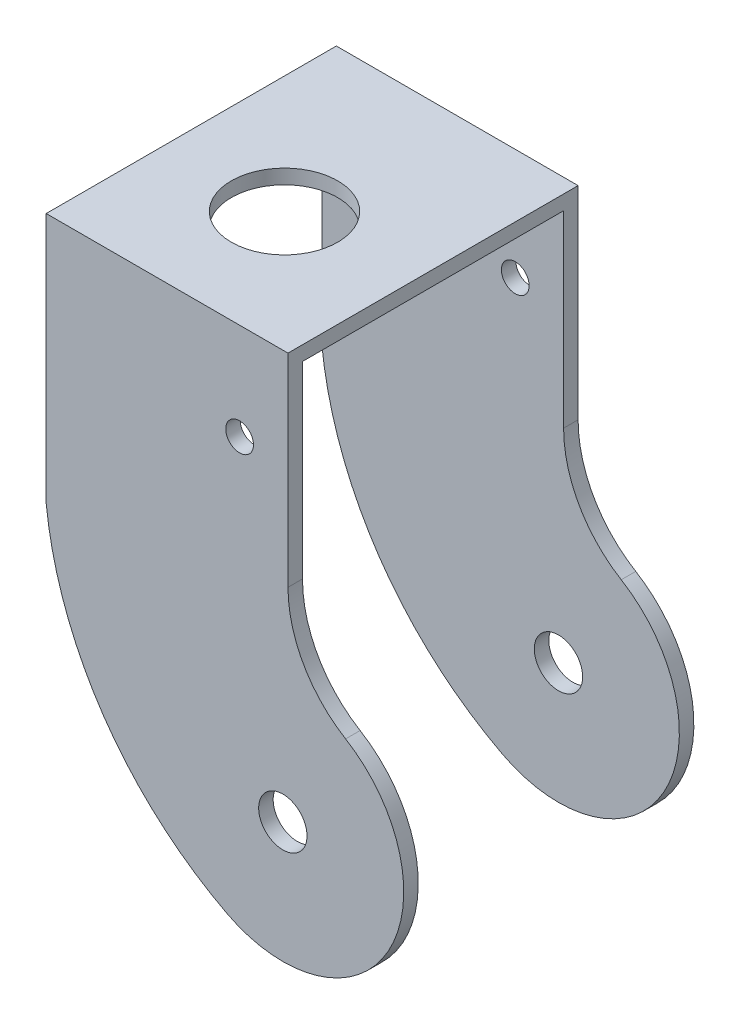
ISO-10303-21;
HEADER;
FILE_DESCRIPTION(('STEP AP214'),'2;1');
FILE_NAME('part.step','',(''),(''),'','','');
FILE_SCHEMA(('AUTOMOTIVE_DESIGN { 1 0 10303 214 1 1 1 1 }'));
ENDSEC;
DATA;
#1=APPLICATION_CONTEXT('core data for automotive mechanical design processes');
#2=APPLICATION_PROTOCOL_DEFINITION('international standard','automotive_design',2000,#1);
#3=PRODUCT_CONTEXT('',#1,'mechanical');
#4=PRODUCT('Part','Part','',(#3));
#5=PRODUCT_RELATED_PRODUCT_CATEGORY('part','',(#4));
#6=PRODUCT_DEFINITION_FORMATION('','',#4);
#7=PRODUCT_DEFINITION_CONTEXT('part definition',#1,'design');
#8=PRODUCT_DEFINITION('design','',#6,#7);
#9=PRODUCT_DEFINITION_SHAPE('','',#8);
#10=(LENGTH_UNIT() NAMED_UNIT(*) SI_UNIT(.MILLI.,.METRE.));
#11=(NAMED_UNIT(*) PLANE_ANGLE_UNIT() SI_UNIT($,.RADIAN.));
#12=(NAMED_UNIT(*) SI_UNIT($,.STERADIAN.) SOLID_ANGLE_UNIT());
#13=UNCERTAINTY_MEASURE_WITH_UNIT(LENGTH_MEASURE(1.E-05),#10,'distance_accuracy_value','');
#14=(GEOMETRIC_REPRESENTATION_CONTEXT(3) GLOBAL_UNCERTAINTY_ASSIGNED_CONTEXT((#13)) GLOBAL_UNIT_ASSIGNED_CONTEXT((#10,
#11,#12)) REPRESENTATION_CONTEXT('',''));
#15=CARTESIAN_POINT('',(0.,0.,0.));
#16=DIRECTION('',(0.,0.,1.));
#17=DIRECTION('',(1.,0.,0.));
#18=AXIS2_PLACEMENT_3D('',#15,#16,#17);
#19=CARTESIAN_POINT('',(45.5585932825074,2.19705499700586,60.));
#20=DIRECTION('',(0.,0.,-1.));
#21=DIRECTION('',(-1.,0.,0.));
#22=AXIS2_PLACEMENT_3D('',#19,#20,#21);
#23=CYLINDRICAL_SURFACE('',#22,70.2497384478621);
#24=DIRECTION('',(0.,0.,-1.));
#25=VECTOR('',#24,1.);
#26=CARTESIAN_POINT('',(-24.2814575535554,-5.37876517042151,60.));
#27=LINE('',#26,#25);
#28=CARTESIAN_POINT('',(-24.2814575535554,-5.37876517042151,60.));
#29=VERTEX_POINT('',#28);
#30=CARTESIAN_POINT('',(-24.2814575535554,-5.37876517042159,57.));
#31=VERTEX_POINT('',#30);
#32=EDGE_CURVE('E161',#29,#31,#27,.T.);
#33=ORIENTED_EDGE('',*,*,#32,.T.);
#34=CARTESIAN_POINT('',(45.5585932825074,2.19705499700586,57.));
#35=DIRECTION('',(0.,0.,1.));
#36=DIRECTION('',(1.,0.,0.));
#37=AXIS2_PLACEMENT_3D('',#34,#35,#36);
#38=CIRCLE('',#37,70.2497384478621);
#39=CARTESIAN_POINT('',(13.107980321312,-60.1085103277365,57.));
#40=VERTEX_POINT('',#39);
#41=EDGE_CURVE('E196',#31,#40,#38,.T.);
#42=ORIENTED_EDGE('',*,*,#41,.T.);
#43=DIRECTION('',(0.,0.,-1.));
#44=VECTOR('',#43,1.);
#45=CARTESIAN_POINT('',(13.107980321312,-60.1085103277365,60.));
#46=LINE('',#45,#44);
#47=CARTESIAN_POINT('',(13.107980321312,-60.1085103277365,60.));
#48=VERTEX_POINT('',#47);
#49=EDGE_CURVE('E158',#48,#40,#46,.T.);
#50=ORIENTED_EDGE('',*,*,#49,.F.);
#51=CARTESIAN_POINT('',(45.5585932825074,2.19705499700586,60.));
#52=DIRECTION('',(0.,0.,1.));
#53=DIRECTION('',(1.,0.,0.));
#54=AXIS2_PLACEMENT_3D('',#51,#52,#53);
#55=CIRCLE('',#54,70.2497384478621);
#56=EDGE_CURVE('E111',#29,#48,#55,.T.);
#57=ORIENTED_EDGE('',*,*,#56,.F.);
#58=EDGE_LOOP('',(#33,#42,#50,#57));
#59=FACE_BOUND('',#58,.T.);
#60=ADVANCED_FACE('F34',(#59),#23,.T.);
#61=CARTESIAN_POINT('',(24.6562841578023,-37.935628726553,60.));
#62=DIRECTION('',(0.,0.,-1.));
#63=DIRECTION('',(-1.,0.,0.));
#64=AXIS2_PLACEMENT_3D('',#61,#62,#63);
#65=CYLINDRICAL_SURFACE('',#64,25.);
#66=DIRECTION('',(0.,0.,-1.));
#67=VECTOR('',#66,1.);
#68=CARTESIAN_POINT('',(37.6384843614041,-16.5706462113811,60.));
#69=LINE('',#68,#67);
#70=CARTESIAN_POINT('',(37.6384843614041,-16.5706462113811,3.00000000000001));
#71=VERTEX_POINT('',#70);
#72=CARTESIAN_POINT('',(37.6384843614041,-16.5706462113811,0.));
#73=VERTEX_POINT('',#72);
#74=EDGE_CURVE('E127',#71,#73,#69,.T.);
#75=ORIENTED_EDGE('',*,*,#74,.F.);
#76=CARTESIAN_POINT('',(24.6562841578023,-37.935628726553,3.00000000000001));
#77=DIRECTION('',(0.,0.,-1.));
#78=DIRECTION('',(0.,1.,0.));
#79=AXIS2_PLACEMENT_3D('',#76,#77,#78);
#80=CIRCLE('',#79,25.);
#81=CARTESIAN_POINT('',(13.107980321312,-60.1085103277365,3.00000000000001));
#82=VERTEX_POINT('',#81);
#83=EDGE_CURVE('E180',#71,#82,#80,.T.);
#84=ORIENTED_EDGE('',*,*,#83,.T.);
#85=CARTESIAN_POINT('',(13.107980321312,-60.1085103277365,0.));
#86=VERTEX_POINT('',#85);
#87=EDGE_CURVE('E126',#82,#86,#46,.T.);
#88=ORIENTED_EDGE('',*,*,#87,.T.);
#89=CARTESIAN_POINT('',(24.6562841578023,-37.935628726553,0.));
#90=DIRECTION('',(0.,0.,1.));
#91=DIRECTION('',(1.,0.,0.));
#92=AXIS2_PLACEMENT_3D('',#89,#90,#91);
#93=CIRCLE('',#92,25.);
#94=EDGE_CURVE('E147',#86,#73,#93,.T.);
#95=ORIENTED_EDGE('',*,*,#94,.T.);
#96=EDGE_LOOP('',(#75,#84,#88,#95));
#97=FACE_BOUND('',#96,.T.);
#98=ADVANCED_FACE('F268',(#97),#65,.T.);
#99=CARTESIAN_POINT('',(50.5149738167941,4.62036669526606,60.));
#100=DIRECTION('',(0.,0.,-1.));
#101=DIRECTION('',(-1.,0.,0.));
#102=AXIS2_PLACEMENT_3D('',#99,#100,#101);
#103=CYLINDRICAL_SURFACE('',#102,24.7964313703496);
#104=CARTESIAN_POINT('',(37.6384843614041,-16.5706462113811,60.));
#105=VERTEX_POINT('',#104);
#106=CARTESIAN_POINT('',(37.6384843614041,-16.5706462113811,57.));
#107=VERTEX_POINT('',#106);
#108=EDGE_CURVE('E118',#105,#107,#69,.T.);
#109=ORIENTED_EDGE('',*,*,#108,.T.);
#110=CARTESIAN_POINT('',(50.5149738167941,4.62036669526606,57.));
#111=DIRECTION('',(0.,0.,1.));
#112=DIRECTION('',(1.,0.,0.));
#113=AXIS2_PLACEMENT_3D('',#110,#111,#112);
#114=CIRCLE('',#113,24.7964313703496);
#115=CARTESIAN_POINT('',(25.7185424464446,4.62036669526606,57.));
#116=VERTEX_POINT('',#115);
#117=EDGE_CURVE('E193',#107,#116,#114,.F.);
#118=ORIENTED_EDGE('',*,*,#117,.T.);
#119=DIRECTION('',(0.,0.,-1.));
#120=VECTOR('',#119,1.);
#121=CARTESIAN_POINT('',(25.7185424464446,4.62036669526606,60.));
#122=LINE('',#121,#120);
#123=CARTESIAN_POINT('',(25.7185424464446,4.62036669526606,60.));
#124=VERTEX_POINT('',#123);
#125=EDGE_CURVE('E131',#124,#116,#122,.T.);
#126=ORIENTED_EDGE('',*,*,#125,.F.);
#127=CARTESIAN_POINT('',(50.5149738167941,4.62036669526606,60.));
#128=DIRECTION('',(0.,0.,-1.));
#129=DIRECTION('',(1.,0.,0.));
#130=AXIS2_PLACEMENT_3D('',#127,#128,#129);
#131=CIRCLE('',#130,24.7964313703496);
#132=EDGE_CURVE('E108',#105,#124,#131,.T.);
#133=ORIENTED_EDGE('',*,*,#132,.F.);
#134=EDGE_LOOP('',(#109,#118,#126,#133));
#135=FACE_BOUND('',#134,.T.);
#136=ADVANCED_FACE('F129',(#135),#103,.F.);
#137=CARTESIAN_POINT('',(24.6562841578023,-37.935628726553,60.));
#138=DIRECTION('',(0.,0.,-1.));
#139=DIRECTION('',(-1.,0.,0.));
#140=AXIS2_PLACEMENT_3D('',#137,#138,#139);
#141=CYLINDRICAL_SURFACE('',#140,5.);
#142=CARTESIAN_POINT('',(24.6562841578023,-37.935628726553,57.));
#143=DIRECTION('',(0.,0.,1.));
#144=DIRECTION('',(1.,0.,0.));
#145=AXIS2_PLACEMENT_3D('',#142,#143,#144);
#146=CIRCLE('',#145,5.);
#147=CARTESIAN_POINT('',(29.6562841578023,-37.935628726553,57.));
#148=VERTEX_POINT('',#147);
#149=EDGE_CURVE('E172',#148,#148,#146,.T.);
#150=ORIENTED_EDGE('',*,*,#149,.F.);
#151=EDGE_LOOP('',(#150));
#152=FACE_BOUND('',#151,.T.);
#153=CARTESIAN_POINT('',(24.6562841578023,-37.935628726553,60.));
#154=DIRECTION('',(0.,0.,1.));
#155=DIRECTION('',(1.,0.,0.));
#156=AXIS2_PLACEMENT_3D('',#153,#154,#155);
#157=CIRCLE('',#156,5.);
#158=CARTESIAN_POINT('',(29.6562841578023,-37.935628726553,60.));
#159=VERTEX_POINT('',#158);
#160=EDGE_CURVE('E141',#159,#159,#157,.T.);
#161=ORIENTED_EDGE('',*,*,#160,.T.);
#162=EDGE_LOOP('',(#161));
#163=FACE_BOUND('',#162,.T.);
#164=ADVANCED_FACE('F361',(#152,#163),#141,.F.);
#165=CARTESIAN_POINT('',(15.7185424464446,26.564371273447,60.));
#166=DIRECTION('',(0.,0.,-1.));
#167=DIRECTION('',(-1.,0.,0.));
#168=AXIS2_PLACEMENT_3D('',#165,#166,#167);
#169=CYLINDRICAL_SURFACE('',#168,2.87033384325827);
#170=CARTESIAN_POINT('',(15.7185424464446,26.564371273447,57.));
#171=DIRECTION('',(0.,0.,1.));
#172=DIRECTION('',(1.,0.,0.));
#173=AXIS2_PLACEMENT_3D('',#170,#171,#172);
#174=CIRCLE('',#173,2.87033384325827);
#175=CARTESIAN_POINT('',(18.5888762897028,26.564371273447,57.));
#176=VERTEX_POINT('',#175);
#177=EDGE_CURVE('E170',#176,#176,#174,.T.);
#178=ORIENTED_EDGE('',*,*,#177,.F.);
#179=EDGE_LOOP('',(#178));
#180=FACE_BOUND('',#179,.T.);
#181=CARTESIAN_POINT('',(15.7185424464446,26.564371273447,60.));
#182=DIRECTION('',(0.,0.,1.));
#183=DIRECTION('',(1.,0.,0.));
#184=AXIS2_PLACEMENT_3D('',#181,#182,#183);
#185=CIRCLE('',#184,2.87033384325827);
#186=CARTESIAN_POINT('',(18.5888762897028,26.564371273447,60.));
#187=VERTEX_POINT('',#186);
#188=EDGE_CURVE('E200',#187,#187,#185,.T.);
#189=ORIENTED_EDGE('',*,*,#188,.T.);
#190=EDGE_LOOP('',(#189));
#191=FACE_BOUND('',#190,.T.);
#192=ADVANCED_FACE('F353',(#180,#191),#169,.F.);
#193=CARTESIAN_POINT('',(50.5149738167941,4.62036669526606,60.));
#194=DIRECTION('',(0.,0.,1.));
#195=DIRECTION('',(1.,0.,0.));
#196=AXIS2_PLACEMENT_3D('',#193,#194,#195);
#197=PLANE('',#196);
#198=ORIENTED_EDGE('',*,*,#160,.F.);
#199=EDGE_LOOP('',(#198));
#200=FACE_BOUND('',#199,.T.);
#201=DIRECTION('',(-1.,0.,0.));
#202=VECTOR('',#201,1.);
#203=CARTESIAN_POINT('',(-24.2814575535555,46.564371273447,60.));
#204=LINE('',#203,#202);
#205=CARTESIAN_POINT('',(25.7185424464445,46.564371273447,60.));
#206=VERTEX_POINT('',#205);
#207=CARTESIAN_POINT('',(-24.2814575535555,46.564371273447,60.));
#208=VERTEX_POINT('',#207);
#209=EDGE_CURVE('E154',#206,#208,#204,.T.);
#210=ORIENTED_EDGE('',*,*,#209,.T.);
#211=DIRECTION('',(0.,-1.,0.));
#212=VECTOR('',#211,1.);
#213=CARTESIAN_POINT('',(-24.2814575535555,46.564371273447,60.));
#214=LINE('',#213,#212);
#215=EDGE_CURVE('E94',#208,#29,#214,.T.);
#216=ORIENTED_EDGE('',*,*,#215,.T.);
#217=ORIENTED_EDGE('',*,*,#56,.T.);
#218=CARTESIAN_POINT('',(24.6562841578023,-37.935628726553,60.));
#219=DIRECTION('',(0.,0.,1.));
#220=DIRECTION('',(1.,0.,0.));
#221=AXIS2_PLACEMENT_3D('',#218,#219,#220);
#222=CIRCLE('',#221,25.);
#223=EDGE_CURVE('E103',#48,#105,#222,.T.);
#224=ORIENTED_EDGE('',*,*,#223,.T.);
#225=ORIENTED_EDGE('',*,*,#132,.T.);
#226=DIRECTION('',(0.,1.,0.));
#227=VECTOR('',#226,1.);
#228=CARTESIAN_POINT('',(25.7185424464445,46.564371273447,60.));
#229=LINE('',#228,#227);
#230=EDGE_CURVE('E59',#124,#206,#229,.T.);
#231=ORIENTED_EDGE('',*,*,#230,.T.);
#232=EDGE_LOOP('',(#210,#216,#217,#224,#225,#231));
#233=FACE_BOUND('',#232,.T.);
#234=ORIENTED_EDGE('',*,*,#188,.F.);
#235=EDGE_LOOP('',(#234));
#236=FACE_BOUND('',#235,.T.);
#237=ADVANCED_FACE('F105',(#200,#233,#236),#197,.T.);
#238=CARTESIAN_POINT('',(50.5149738167941,4.62036669526606,0.));
#239=DIRECTION('',(0.,0.,1.));
#240=DIRECTION('',(1.,0.,0.));
#241=AXIS2_PLACEMENT_3D('',#238,#239,#240);
#242=PLANE('',#241);
#243=DIRECTION('',(-1.,0.,0.));
#244=VECTOR('',#243,1.);
#245=CARTESIAN_POINT('',(-24.2814575535555,46.564371273447,0.));
#246=LINE('',#245,#244);
#247=CARTESIAN_POINT('',(25.7185424464445,46.564371273447,0.));
#248=VERTEX_POINT('',#247);
#249=CARTESIAN_POINT('',(-24.2814575535555,46.564371273447,0.));
#250=VERTEX_POINT('',#249);
#251=EDGE_CURVE('E137',#248,#250,#246,.T.);
#252=ORIENTED_EDGE('',*,*,#251,.F.);
#253=DIRECTION('',(0.,1.,0.));
#254=VECTOR('',#253,1.);
#255=CARTESIAN_POINT('',(25.7185424464445,46.564371273447,0.));
#256=LINE('',#255,#254);
#257=CARTESIAN_POINT('',(25.7185424464446,4.62036669526606,0.));
#258=VERTEX_POINT('',#257);
#259=EDGE_CURVE('E85',#258,#248,#256,.T.);
#260=ORIENTED_EDGE('',*,*,#259,.F.);
#261=CARTESIAN_POINT('',(50.5149738167941,4.62036669526606,0.));
#262=DIRECTION('',(0.,0.,-1.));
#263=DIRECTION('',(1.,0.,0.));
#264=AXIS2_PLACEMENT_3D('',#261,#262,#263);
#265=CIRCLE('',#264,24.7964313703496);
#266=EDGE_CURVE('E150',#73,#258,#265,.T.);
#267=ORIENTED_EDGE('',*,*,#266,.F.);
#268=ORIENTED_EDGE('',*,*,#94,.F.);
#269=CARTESIAN_POINT('',(45.5585932825074,2.19705499700586,0.));
#270=DIRECTION('',(0.,0.,1.));
#271=DIRECTION('',(1.,0.,0.));
#272=AXIS2_PLACEMENT_3D('',#269,#270,#271);
#273=CIRCLE('',#272,70.2497384478621);
#274=CARTESIAN_POINT('',(-24.2814575535554,-5.37876517042151,0.));
#275=VERTEX_POINT('',#274);
#276=EDGE_CURVE('E144',#275,#86,#273,.T.);
#277=ORIENTED_EDGE('',*,*,#276,.F.);
#278=DIRECTION('',(0.,-1.,0.));
#279=VECTOR('',#278,1.);
#280=CARTESIAN_POINT('',(-24.2814575535555,46.564371273447,0.));
#281=LINE('',#280,#279);
#282=EDGE_CURVE('E140',#250,#275,#281,.T.);
#283=ORIENTED_EDGE('',*,*,#282,.F.);
#284=EDGE_LOOP('',(#252,#260,#267,#268,#277,#283));
#285=FACE_BOUND('',#284,.T.);
#286=CARTESIAN_POINT('',(24.6562841578023,-37.935628726553,0.));
#287=DIRECTION('',(0.,0.,1.));
#288=DIRECTION('',(1.,0.,0.));
#289=AXIS2_PLACEMENT_3D('',#286,#287,#288);
#290=CIRCLE('',#289,5.);
#291=CARTESIAN_POINT('',(29.6562841578023,-37.935628726553,0.));
#292=VERTEX_POINT('',#291);
#293=EDGE_CURVE('E203',#292,#292,#290,.T.);
#294=ORIENTED_EDGE('',*,*,#293,.T.);
#295=EDGE_LOOP('',(#294));
#296=FACE_BOUND('',#295,.T.);
#297=CARTESIAN_POINT('',(15.7185424464446,26.564371273447,0.));
#298=DIRECTION('',(0.,0.,1.));
#299=DIRECTION('',(1.,0.,0.));
#300=AXIS2_PLACEMENT_3D('',#297,#298,#299);
#301=CIRCLE('',#300,2.87033384325827);
#302=CARTESIAN_POINT('',(18.5888762897028,26.564371273447,0.));
#303=VERTEX_POINT('',#302);
#304=EDGE_CURVE('E199',#303,#303,#301,.T.);
#305=ORIENTED_EDGE('',*,*,#304,.T.);
#306=EDGE_LOOP('',(#305));
#307=FACE_BOUND('',#306,.T.);
#308=ADVANCED_FACE('F274',(#285,#296,#307),#242,.F.);
#309=CARTESIAN_POINT('',(-24.2814575535555,46.564371273447,60.));
#310=DIRECTION('',(0.,-1.,0.));
#311=DIRECTION('',(0.,0.,-1.));
#312=AXIS2_PLACEMENT_3D('',#309,#310,#311);
#313=PLANE('',#312);
#314=CARTESIAN_POINT('',(0.,46.564371273447,35.));
#315=DIRECTION('',(0.,1.,0.));
#316=DIRECTION('',(0.,0.,1.));
#317=AXIS2_PLACEMENT_3D('',#314,#315,#316);
#318=CIRCLE('',#317,11.);
#319=CARTESIAN_POINT('',(0.,46.564371273447,46.));
#320=VERTEX_POINT('',#319);
#321=EDGE_CURVE('E315',#320,#320,#318,.T.);
#322=ORIENTED_EDGE('',*,*,#321,.F.);
#323=EDGE_LOOP('',(#322));
#324=FACE_BOUND('',#323,.T.);
#325=ORIENTED_EDGE('',*,*,#251,.T.);
#326=DIRECTION('',(0.,0.,-1.));
#327=VECTOR('',#326,1.);
#328=CARTESIAN_POINT('',(-24.2814575535555,46.564371273447,60.));
#329=LINE('',#328,#327);
#330=EDGE_CURVE('E43',#208,#250,#329,.T.);
#331=ORIENTED_EDGE('',*,*,#330,.F.);
#332=ORIENTED_EDGE('',*,*,#209,.F.);
#333=DIRECTION('',(0.,0.,-1.));
#334=VECTOR('',#333,1.);
#335=CARTESIAN_POINT('',(25.7185424464445,46.564371273447,60.));
#336=LINE('',#335,#334);
#337=EDGE_CURVE('E133',#206,#248,#336,.T.);
#338=ORIENTED_EDGE('',*,*,#337,.T.);
#339=EDGE_LOOP('',(#325,#331,#332,#338));
#340=FACE_BOUND('',#339,.T.);
#341=ADVANCED_FACE('F36',(#324,#340),#313,.F.);
#342=CARTESIAN_POINT('',(-24.2814575535555,46.564371273447,60.));
#343=DIRECTION('',(1.,0.,0.));
#344=DIRECTION('',(0.,1.,0.));
#345=AXIS2_PLACEMENT_3D('',#342,#343,#344);
#346=PLANE('',#345);
#347=DIRECTION('',(0.,0.,-1.));
#348=VECTOR('',#347,1.);
#349=CARTESIAN_POINT('',(-24.2814575535555,43.564371273447,57.));
#350=LINE('',#349,#348);
#351=CARTESIAN_POINT('',(-24.2814575535555,43.564371273447,57.));
#352=VERTEX_POINT('',#351);
#353=CARTESIAN_POINT('',(-24.2814575535555,43.564371273447,3.));
#354=VERTEX_POINT('',#353);
#355=EDGE_CURVE('E252',#352,#354,#350,.T.);
#356=ORIENTED_EDGE('',*,*,#355,.F.);
#357=DIRECTION('',(0.,1.,0.));
#358=VECTOR('',#357,1.);
#359=CARTESIAN_POINT('',(-24.2814575535554,-96.1227793901019,57.));
#360=LINE('',#359,#358);
#361=EDGE_CURVE('E218',#31,#352,#360,.T.);
#362=ORIENTED_EDGE('',*,*,#361,.F.);
#363=ORIENTED_EDGE('',*,*,#32,.F.);
#364=ORIENTED_EDGE('',*,*,#215,.F.);
#365=ORIENTED_EDGE('',*,*,#330,.T.);
#366=ORIENTED_EDGE('',*,*,#282,.T.);
#367=CARTESIAN_POINT('',(-24.2814575535554,-5.37876517042159,3.00000000000001));
#368=VERTEX_POINT('',#367);
#369=EDGE_CURVE('E160',#368,#275,#27,.T.);
#370=ORIENTED_EDGE('',*,*,#369,.F.);
#371=DIRECTION('',(0.,-1.,0.));
#372=VECTOR('',#371,1.);
#373=CARTESIAN_POINT('',(-24.2814575535555,43.564371273447,3.));
#374=LINE('',#373,#372);
#375=EDGE_CURVE('E248',#354,#368,#374,.T.);
#376=ORIENTED_EDGE('',*,*,#375,.F.);
#377=EDGE_LOOP('',(#356,#362,#363,#364,#365,#366,#370,#376));
#378=FACE_BOUND('',#377,.T.);
#379=ADVANCED_FACE('F215',(#378),#346,.F.);
#380=ORIENTED_EDGE('',*,*,#87,.F.);
#381=CARTESIAN_POINT('',(45.5585932825074,2.19705499700586,3.00000000000001));
#382=DIRECTION('',(0.,0.,-1.));
#383=DIRECTION('',(0.,1.,0.));
#384=AXIS2_PLACEMENT_3D('',#381,#382,#383);
#385=CIRCLE('',#384,70.2497384478621);
#386=EDGE_CURVE('E173',#82,#368,#385,.T.);
#387=ORIENTED_EDGE('',*,*,#386,.T.);
#388=ORIENTED_EDGE('',*,*,#369,.T.);
#389=ORIENTED_EDGE('',*,*,#276,.T.);
#390=EDGE_LOOP('',(#380,#387,#388,#389));
#391=FACE_BOUND('',#390,.T.);
#392=ADVANCED_FACE('F295',(#391),#23,.T.);
#393=CARTESIAN_POINT('',(24.6562841578023,-37.935628726553,57.));
#394=DIRECTION('',(0.,0.,1.));
#395=DIRECTION('',(1.,0.,0.));
#396=AXIS2_PLACEMENT_3D('',#393,#394,#395);
#397=CIRCLE('',#396,25.);
#398=EDGE_CURVE('E122',#40,#107,#397,.T.);
#399=ORIENTED_EDGE('',*,*,#398,.T.);
#400=ORIENTED_EDGE('',*,*,#108,.F.);
#401=ORIENTED_EDGE('',*,*,#223,.F.);
#402=ORIENTED_EDGE('',*,*,#49,.T.);
#403=EDGE_LOOP('',(#399,#400,#401,#402));
#404=FACE_BOUND('',#403,.T.);
#405=ADVANCED_FACE('F119',(#404),#65,.T.);
#406=CARTESIAN_POINT('',(25.7185424464446,4.62036669526606,3.));
#407=VERTEX_POINT('',#406);
#408=EDGE_CURVE('E156',#407,#258,#122,.T.);
#409=ORIENTED_EDGE('',*,*,#408,.F.);
#410=CARTESIAN_POINT('',(50.5149738167941,4.62036669526606,3.00000000000001));
#411=DIRECTION('',(0.,0.,-1.));
#412=DIRECTION('',(0.,1.,0.));
#413=AXIS2_PLACEMENT_3D('',#410,#411,#412);
#414=CIRCLE('',#413,24.7964313703496);
#415=EDGE_CURVE('E50',#407,#71,#414,.F.);
#416=ORIENTED_EDGE('',*,*,#415,.T.);
#417=ORIENTED_EDGE('',*,*,#74,.T.);
#418=ORIENTED_EDGE('',*,*,#266,.T.);
#419=EDGE_LOOP('',(#409,#416,#417,#418));
#420=FACE_BOUND('',#419,.T.);
#421=ADVANCED_FACE('F266',(#420),#103,.F.);
#422=CARTESIAN_POINT('',(25.7185424464445,46.564371273447,60.));
#423=DIRECTION('',(-1.,0.,0.));
#424=DIRECTION('',(0.,-1.,0.));
#425=AXIS2_PLACEMENT_3D('',#422,#423,#424);
#426=PLANE('',#425);
#427=ORIENTED_EDGE('',*,*,#125,.T.);
#428=DIRECTION('',(0.,1.,0.));
#429=VECTOR('',#428,1.);
#430=CARTESIAN_POINT('',(25.7185424464445,46.564371273447,57.));
#431=LINE('',#430,#429);
#432=CARTESIAN_POINT('',(25.7185424464446,43.564371273447,57.));
#433=VERTEX_POINT('',#432);
#434=EDGE_CURVE('E177',#116,#433,#431,.T.);
#435=ORIENTED_EDGE('',*,*,#434,.T.);
#436=DIRECTION('',(0.,0.,-1.));
#437=VECTOR('',#436,1.);
#438=CARTESIAN_POINT('',(25.7185424464445,43.564371273447,60.));
#439=LINE('',#438,#437);
#440=CARTESIAN_POINT('',(25.7185424464446,43.564371273447,3.));
#441=VERTEX_POINT('',#440);
#442=EDGE_CURVE('E11',#433,#441,#439,.T.);
#443=ORIENTED_EDGE('',*,*,#442,.T.);
#444=DIRECTION('',(0.,-1.,0.));
#445=VECTOR('',#444,1.);
#446=CARTESIAN_POINT('',(25.7185424464445,46.564371273447,3.));
#447=LINE('',#446,#445);
#448=EDGE_CURVE('E249',#441,#407,#447,.T.);
#449=ORIENTED_EDGE('',*,*,#448,.T.);
#450=ORIENTED_EDGE('',*,*,#408,.T.);
#451=ORIENTED_EDGE('',*,*,#259,.T.);
#452=ORIENTED_EDGE('',*,*,#337,.F.);
#453=ORIENTED_EDGE('',*,*,#230,.F.);
#454=EDGE_LOOP('',(#427,#435,#443,#449,#450,#451,#452,#453));
#455=FACE_BOUND('',#454,.T.);
#456=ADVANCED_FACE('F277',(#455),#426,.F.);
#457=CARTESIAN_POINT('',(24.6562841578023,-37.935628726553,3.00000000000001));
#458=DIRECTION('',(0.,0.,-1.));
#459=DIRECTION('',(0.,1.,0.));
#460=AXIS2_PLACEMENT_3D('',#457,#458,#459);
#461=CIRCLE('',#460,5.);
#462=CARTESIAN_POINT('',(24.6562841578023,-32.935628726553,3.00000000000001));
#463=VERTEX_POINT('',#462);
#464=EDGE_CURVE('E168',#463,#463,#461,.T.);
#465=ORIENTED_EDGE('',*,*,#464,.F.);
#466=EDGE_LOOP('',(#465));
#467=FACE_BOUND('',#466,.T.);
#468=ORIENTED_EDGE('',*,*,#293,.F.);
#469=EDGE_LOOP('',(#468));
#470=FACE_BOUND('',#469,.T.);
#471=ADVANCED_FACE('F350',(#467,#470),#141,.F.);
#472=CARTESIAN_POINT('',(15.7185424464446,26.564371273447,3.));
#473=DIRECTION('',(0.,0.,-1.));
#474=DIRECTION('',(0.,1.,0.));
#475=AXIS2_PLACEMENT_3D('',#472,#473,#474);
#476=CIRCLE('',#475,2.87033384325827);
#477=CARTESIAN_POINT('',(15.7185424464446,29.4347051167053,3.));
#478=VERTEX_POINT('',#477);
#479=EDGE_CURVE('E165',#478,#478,#476,.T.);
#480=ORIENTED_EDGE('',*,*,#479,.F.);
#481=EDGE_LOOP('',(#480));
#482=FACE_BOUND('',#481,.T.);
#483=ORIENTED_EDGE('',*,*,#304,.F.);
#484=EDGE_LOOP('',(#483));
#485=FACE_BOUND('',#484,.T.);
#486=ADVANCED_FACE('F289',(#482,#485),#169,.F.);
#487=CARTESIAN_POINT('',(49.6562841578023,43.564371273447,57.));
#488=DIRECTION('',(0.,1.,0.));
#489=DIRECTION('',(0.,0.,1.));
#490=AXIS2_PLACEMENT_3D('',#487,#488,#489);
#491=PLANE('',#490);
#492=CARTESIAN_POINT('',(0.,43.564371273447,35.));
#493=DIRECTION('',(0.,1.,0.));
#494=DIRECTION('',(0.,0.,1.));
#495=AXIS2_PLACEMENT_3D('',#492,#493,#494);
#496=CIRCLE('',#495,11.);
#497=CARTESIAN_POINT('',(0.,43.564371273447,46.));
#498=VERTEX_POINT('',#497);
#499=EDGE_CURVE('E38',#498,#498,#496,.T.);
#500=ORIENTED_EDGE('',*,*,#499,.T.);
#501=EDGE_LOOP('',(#500));
#502=FACE_BOUND('',#501,.T.);
#503=DIRECTION('',(-1.,0.,0.));
#504=VECTOR('',#503,1.);
#505=CARTESIAN_POINT('',(49.6562841578023,43.564371273447,57.));
#506=LINE('',#505,#504);
#507=EDGE_CURVE('E169',#433,#352,#506,.T.);
#508=ORIENTED_EDGE('',*,*,#507,.T.);
#509=ORIENTED_EDGE('',*,*,#355,.T.);
#510=DIRECTION('',(-1.,0.,0.));
#511=VECTOR('',#510,1.);
#512=CARTESIAN_POINT('',(49.6562841578023,43.564371273447,3.));
#513=LINE('',#512,#511);
#514=EDGE_CURVE('E244',#441,#354,#513,.T.);
#515=ORIENTED_EDGE('',*,*,#514,.F.);
#516=ORIENTED_EDGE('',*,*,#442,.F.);
#517=EDGE_LOOP('',(#508,#509,#515,#516));
#518=FACE_BOUND('',#517,.T.);
#519=ADVANCED_FACE('F253',(#502,#518),#491,.F.);
#520=CARTESIAN_POINT('',(49.6562841578023,-96.1227793901019,57.));
#521=DIRECTION('',(0.,0.,1.));
#522=DIRECTION('',(1.,0.,0.));
#523=AXIS2_PLACEMENT_3D('',#520,#521,#522);
#524=PLANE('',#523);
#525=ORIENTED_EDGE('',*,*,#149,.T.);
#526=EDGE_LOOP('',(#525));
#527=FACE_BOUND('',#526,.T.);
#528=ORIENTED_EDGE('',*,*,#177,.T.);
#529=EDGE_LOOP('',(#528));
#530=FACE_BOUND('',#529,.T.);
#531=ORIENTED_EDGE('',*,*,#361,.T.);
#532=ORIENTED_EDGE('',*,*,#507,.F.);
#533=ORIENTED_EDGE('',*,*,#434,.F.);
#534=ORIENTED_EDGE('',*,*,#117,.F.);
#535=ORIENTED_EDGE('',*,*,#398,.F.);
#536=ORIENTED_EDGE('',*,*,#41,.F.);
#537=EDGE_LOOP('',(#531,#532,#533,#534,#535,#536));
#538=FACE_BOUND('',#537,.T.);
#539=ADVANCED_FACE('F278',(#527,#530,#538),#524,.F.);
#540=CARTESIAN_POINT('',(49.6562841578023,43.564371273447,3.));
#541=DIRECTION('',(0.,0.,-1.));
#542=DIRECTION('',(0.,1.,0.));
#543=AXIS2_PLACEMENT_3D('',#540,#541,#542);
#544=PLANE('',#543);
#545=ORIENTED_EDGE('',*,*,#464,.T.);
#546=EDGE_LOOP('',(#545));
#547=FACE_BOUND('',#546,.T.);
#548=ORIENTED_EDGE('',*,*,#479,.T.);
#549=EDGE_LOOP('',(#548));
#550=FACE_BOUND('',#549,.T.);
#551=ORIENTED_EDGE('',*,*,#83,.F.);
#552=ORIENTED_EDGE('',*,*,#415,.F.);
#553=ORIENTED_EDGE('',*,*,#448,.F.);
#554=ORIENTED_EDGE('',*,*,#514,.T.);
#555=ORIENTED_EDGE('',*,*,#375,.T.);
#556=ORIENTED_EDGE('',*,*,#386,.F.);
#557=EDGE_LOOP('',(#551,#552,#553,#554,#555,#556));
#558=FACE_BOUND('',#557,.T.);
#559=ADVANCED_FACE('F246',(#547,#550,#558),#544,.F.);
#560=CARTESIAN_POINT('',(0.,-23.435628726553,35.));
#561=DIRECTION('',(0.,1.,0.));
#562=DIRECTION('',(0.,0.,1.));
#563=AXIS2_PLACEMENT_3D('',#560,#561,#562);
#564=CYLINDRICAL_SURFACE('',#563,11.);
#565=ORIENTED_EDGE('',*,*,#321,.T.);
#566=EDGE_LOOP('',(#565));
#567=FACE_BOUND('',#566,.T.);
#568=ORIENTED_EDGE('',*,*,#499,.F.);
#569=EDGE_LOOP('',(#568));
#570=FACE_BOUND('',#569,.T.);
#571=ADVANCED_FACE('F286',(#567,#570),#564,.F.);
#572=CLOSED_SHELL('',(#60,#98,#136,#164,#192,#237,#308,#341,#379,#392,#405,#421,#456,#471,#486,
#519,#539,#559,#571));
#573=MANIFOLD_SOLID_BREP('B2',#572);
#574=ADVANCED_BREP_SHAPE_REPRESENTATION('',(#18,#573),#14);
#575=SHAPE_DEFINITION_REPRESENTATION(#9,#574);
ENDSEC;
END-ISO-10303-21;
